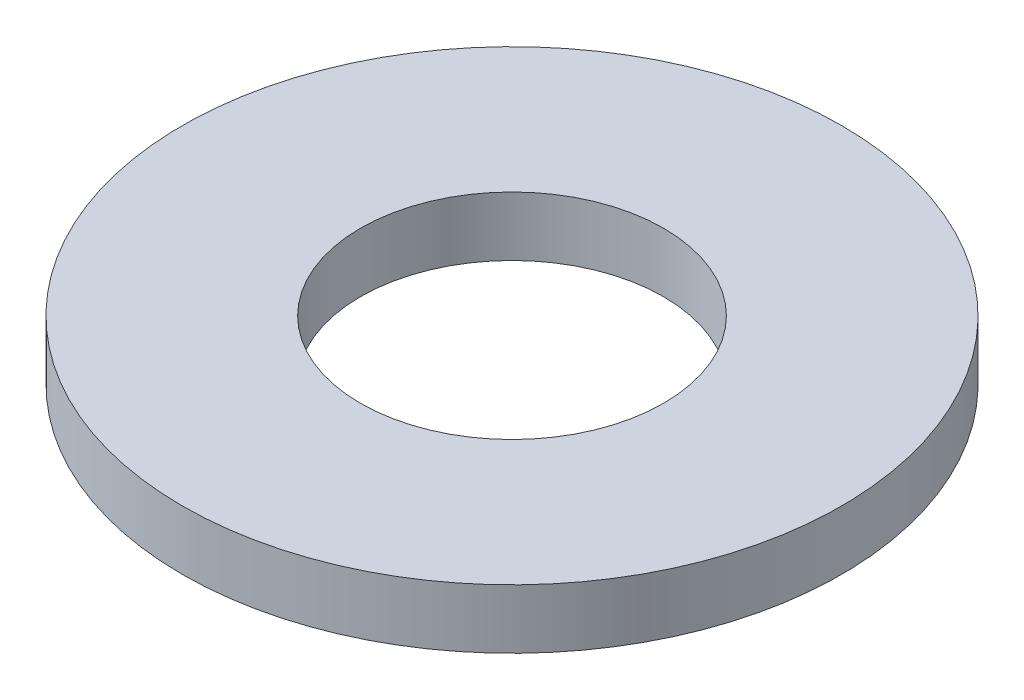
ISO-10303-21;
HEADER;
FILE_DESCRIPTION(('STEP AP214'),'2;1');
FILE_NAME('part.step','',(''),(''),'','','');
FILE_SCHEMA(('AUTOMOTIVE_DESIGN { 1 0 10303 214 1 1 1 1 }'));
ENDSEC;
DATA;
#1=APPLICATION_CONTEXT('core data for automotive mechanical design processes');
#2=APPLICATION_PROTOCOL_DEFINITION('international standard','automotive_design',2000,#1);
#3=PRODUCT_CONTEXT('',#1,'mechanical');
#4=PRODUCT('Part','Part','',(#3));
#5=PRODUCT_RELATED_PRODUCT_CATEGORY('part','',(#4));
#6=PRODUCT_DEFINITION_FORMATION('','',#4);
#7=PRODUCT_DEFINITION_CONTEXT('part definition',#1,'design');
#8=PRODUCT_DEFINITION('design','',#6,#7);
#9=PRODUCT_DEFINITION_SHAPE('','',#8);
#10=(LENGTH_UNIT() NAMED_UNIT(*) SI_UNIT(.MILLI.,.METRE.));
#11=(NAMED_UNIT(*) PLANE_ANGLE_UNIT() SI_UNIT($,.RADIAN.));
#12=(NAMED_UNIT(*) SI_UNIT($,.STERADIAN.) SOLID_ANGLE_UNIT());
#13=UNCERTAINTY_MEASURE_WITH_UNIT(LENGTH_MEASURE(1.E-05),#10,'distance_accuracy_value','');
#14=(GEOMETRIC_REPRESENTATION_CONTEXT(3) GLOBAL_UNCERTAINTY_ASSIGNED_CONTEXT((#13)) GLOBAL_UNIT_ASSIGNED_CONTEXT((#10,
#11,#12)) REPRESENTATION_CONTEXT('',''));
#15=CARTESIAN_POINT('',(0.,0.,0.));
#16=DIRECTION('',(0.,0.,1.));
#17=DIRECTION('',(1.,0.,0.));
#18=AXIS2_PLACEMENT_3D('',#15,#16,#17);
#19=CARTESIAN_POINT('',(0.,1.125,0.));
#20=DIRECTION('',(0.,1.,0.));
#21=DIRECTION('',(0.,0.,1.));
#22=AXIS2_PLACEMENT_3D('',#19,#20,#21);
#23=PLANE('',#22);
#24=CARTESIAN_POINT('',(0.,1.125,0.));
#25=DIRECTION('',(0.,1.,0.));
#26=DIRECTION('',(0.,0.,1.));
#27=AXIS2_PLACEMENT_3D('',#24,#25,#26);
#28=CIRCLE('',#27,12.5);
#29=CARTESIAN_POINT('',(0.,1.125,12.5));
#30=VERTEX_POINT('',#29);
#31=EDGE_CURVE('E10',#30,#30,#28,.T.);
#32=ORIENTED_EDGE('',*,*,#31,.T.);
#33=EDGE_LOOP('',(#32));
#34=FACE_BOUND('',#33,.T.);
#35=CARTESIAN_POINT('',(0.,1.125,0.));
#36=DIRECTION('',(0.,1.,0.));
#37=DIRECTION('',(0.,0.,1.));
#38=AXIS2_PLACEMENT_3D('',#35,#36,#37);
#39=CIRCLE('',#38,5.75);
#40=CARTESIAN_POINT('',(0.,1.125,5.75));
#41=VERTEX_POINT('',#40);
#42=EDGE_CURVE('E41',#41,#41,#39,.T.);
#43=ORIENTED_EDGE('',*,*,#42,.F.);
#44=EDGE_LOOP('',(#43));
#45=FACE_BOUND('',#44,.T.);
#46=ADVANCED_FACE('F30',(#34,#45),#23,.T.);
#47=CARTESIAN_POINT('',(0.,-1.125,0.));
#48=DIRECTION('',(0.,1.,0.));
#49=DIRECTION('',(0.,0.,1.));
#50=AXIS2_PLACEMENT_3D('',#47,#48,#49);
#51=PLANE('',#50);
#52=CARTESIAN_POINT('',(0.,-1.125,0.));
#53=DIRECTION('',(0.,1.,0.));
#54=DIRECTION('',(0.,0.,1.));
#55=AXIS2_PLACEMENT_3D('',#52,#53,#54);
#56=CIRCLE('',#55,12.5);
#57=CARTESIAN_POINT('',(0.,-1.125,12.5));
#58=VERTEX_POINT('',#57);
#59=EDGE_CURVE('E34',#58,#58,#56,.T.);
#60=ORIENTED_EDGE('',*,*,#59,.F.);
#61=EDGE_LOOP('',(#60));
#62=FACE_BOUND('',#61,.T.);
#63=CARTESIAN_POINT('',(0.,-1.125,0.));
#64=DIRECTION('',(0.,1.,0.));
#65=DIRECTION('',(0.,0.,1.));
#66=AXIS2_PLACEMENT_3D('',#63,#64,#65);
#67=CIRCLE('',#66,5.75);
#68=CARTESIAN_POINT('',(0.,-1.125,5.75));
#69=VERTEX_POINT('',#68);
#70=EDGE_CURVE('E43',#69,#69,#67,.T.);
#71=ORIENTED_EDGE('',*,*,#70,.T.);
#72=EDGE_LOOP('',(#71));
#73=FACE_BOUND('',#72,.T.);
#74=ADVANCED_FACE('F53',(#62,#73),#51,.F.);
#75=CARTESIAN_POINT('',(0.,1.125,0.));
#76=DIRECTION('',(0.,-1.,0.));
#77=DIRECTION('',(0.,0.,-1.));
#78=AXIS2_PLACEMENT_3D('',#75,#76,#77);
#79=CYLINDRICAL_SURFACE('',#78,12.5);
#80=ORIENTED_EDGE('',*,*,#31,.F.);
#81=EDGE_LOOP('',(#80));
#82=FACE_BOUND('',#81,.T.);
#83=ORIENTED_EDGE('',*,*,#59,.T.);
#84=EDGE_LOOP('',(#83));
#85=FACE_BOUND('',#84,.T.);
#86=ADVANCED_FACE('F32',(#82,#85),#79,.T.);
#87=CARTESIAN_POINT('',(0.,1.125,0.));
#88=DIRECTION('',(0.,-1.,0.));
#89=DIRECTION('',(0.,0.,-1.));
#90=AXIS2_PLACEMENT_3D('',#87,#88,#89);
#91=CYLINDRICAL_SURFACE('',#90,5.75);
#92=ORIENTED_EDGE('',*,*,#42,.T.);
#93=EDGE_LOOP('',(#92));
#94=FACE_BOUND('',#93,.T.);
#95=ORIENTED_EDGE('',*,*,#70,.F.);
#96=EDGE_LOOP('',(#95));
#97=FACE_BOUND('',#96,.T.);
#98=ADVANCED_FACE('F49',(#94,#97),#91,.F.);
#99=CLOSED_SHELL('',(#46,#74,#86,#98));
#100=MANIFOLD_SOLID_BREP('B2',#99);
#101=ADVANCED_BREP_SHAPE_REPRESENTATION('',(#18,#100),#14);
#102=SHAPE_DEFINITION_REPRESENTATION(#9,#101);
ENDSEC;
END-ISO-10303-21;
